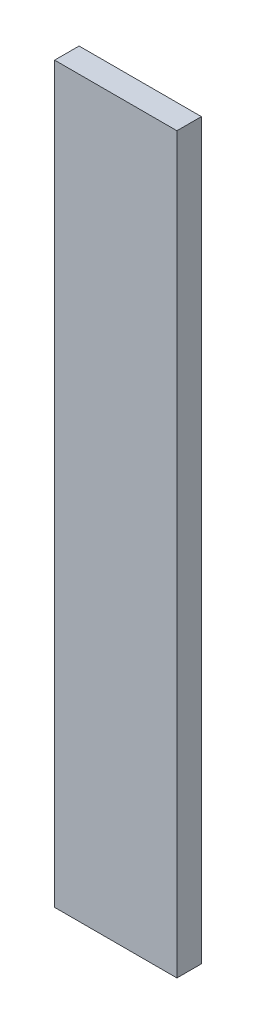
ISO-10303-21;
HEADER;
FILE_DESCRIPTION(('STEP AP214'),'2;1');
FILE_NAME('part.step','',(''),(''),'','','');
FILE_SCHEMA(('AUTOMOTIVE_DESIGN { 1 0 10303 214 1 1 1 1 }'));
ENDSEC;
DATA;
#1=APPLICATION_CONTEXT('core data for automotive mechanical design processes');
#2=APPLICATION_PROTOCOL_DEFINITION('international standard','automotive_design',2000,#1);
#3=PRODUCT_CONTEXT('',#1,'mechanical');
#4=PRODUCT('Part','Part','',(#3));
#5=PRODUCT_RELATED_PRODUCT_CATEGORY('part','',(#4));
#6=PRODUCT_DEFINITION_FORMATION('','',#4);
#7=PRODUCT_DEFINITION_CONTEXT('part definition',#1,'design');
#8=PRODUCT_DEFINITION('design','',#6,#7);
#9=PRODUCT_DEFINITION_SHAPE('','',#8);
#10=(LENGTH_UNIT() NAMED_UNIT(*) SI_UNIT(.MILLI.,.METRE.));
#11=(NAMED_UNIT(*) PLANE_ANGLE_UNIT() SI_UNIT($,.RADIAN.));
#12=(NAMED_UNIT(*) SI_UNIT($,.STERADIAN.) SOLID_ANGLE_UNIT());
#13=UNCERTAINTY_MEASURE_WITH_UNIT(LENGTH_MEASURE(1.E-05),#10,'distance_accuracy_value','');
#14=(GEOMETRIC_REPRESENTATION_CONTEXT(3) GLOBAL_UNCERTAINTY_ASSIGNED_CONTEXT((#13)) GLOBAL_UNIT_ASSIGNED_CONTEXT((#10,
#11,#12)) REPRESENTATION_CONTEXT('',''));
#15=CARTESIAN_POINT('',(0.,0.,0.));
#16=DIRECTION('',(0.,0.,1.));
#17=DIRECTION('',(1.,0.,0.));
#18=AXIS2_PLACEMENT_3D('',#15,#16,#17);
#19=CARTESIAN_POINT('',(0.,300.,10.));
#20=DIRECTION('',(0.,1.,0.));
#21=DIRECTION('',(0.,0.,1.));
#22=AXIS2_PLACEMENT_3D('',#19,#20,#21);
#23=PLANE('',#22);
#24=DIRECTION('',(1.,0.,0.));
#25=VECTOR('',#24,1.);
#26=CARTESIAN_POINT('',(0.,300.,0.));
#27=LINE('',#26,#25);
#28=CARTESIAN_POINT('',(0.,300.,0.));
#29=VERTEX_POINT('',#28);
#30=CARTESIAN_POINT('',(50.,300.,0.));
#31=VERTEX_POINT('',#30);
#32=EDGE_CURVE('E99',#29,#31,#27,.T.);
#33=ORIENTED_EDGE('',*,*,#32,.F.);
#34=DIRECTION('',(0.,0.,-1.));
#35=VECTOR('',#34,1.);
#36=CARTESIAN_POINT('',(0.,300.,10.));
#37=LINE('',#36,#35);
#38=CARTESIAN_POINT('',(0.,300.,10.));
#39=VERTEX_POINT('',#38);
#40=EDGE_CURVE('E11',#39,#29,#37,.T.);
#41=ORIENTED_EDGE('',*,*,#40,.F.);
#42=DIRECTION('',(1.,0.,0.));
#43=VECTOR('',#42,1.);
#44=CARTESIAN_POINT('',(0.,300.,10.));
#45=LINE('',#44,#43);
#46=CARTESIAN_POINT('',(50.,300.,10.));
#47=VERTEX_POINT('',#46);
#48=EDGE_CURVE('E93',#39,#47,#45,.T.);
#49=ORIENTED_EDGE('',*,*,#48,.T.);
#50=DIRECTION('',(0.,0.,-1.));
#51=VECTOR('',#50,1.);
#52=CARTESIAN_POINT('',(50.,300.,10.));
#53=LINE('',#52,#51);
#54=EDGE_CURVE('E38',#47,#31,#53,.T.);
#55=ORIENTED_EDGE('',*,*,#54,.T.);
#56=EDGE_LOOP('',(#33,#41,#49,#55));
#57=FACE_BOUND('',#56,.T.);
#58=ADVANCED_FACE('F35',(#57),#23,.T.);
#59=CARTESIAN_POINT('',(0.,0.,10.));
#60=DIRECTION('',(-1.,0.,0.));
#61=DIRECTION('',(0.,0.,1.));
#62=AXIS2_PLACEMENT_3D('',#59,#60,#61);
#63=PLANE('',#62);
#64=DIRECTION('',(0.,1.,0.));
#65=VECTOR('',#64,1.);
#66=CARTESIAN_POINT('',(0.,0.,0.));
#67=LINE('',#66,#65);
#68=CARTESIAN_POINT('',(0.,0.,0.));
#69=VERTEX_POINT('',#68);
#70=EDGE_CURVE('E95',#69,#29,#67,.T.);
#71=ORIENTED_EDGE('',*,*,#70,.F.);
#72=DIRECTION('',(0.,0.,-1.));
#73=VECTOR('',#72,1.);
#74=CARTESIAN_POINT('',(0.,0.,10.));
#75=LINE('',#74,#73);
#76=CARTESIAN_POINT('',(0.,0.,10.));
#77=VERTEX_POINT('',#76);
#78=EDGE_CURVE('E44',#77,#69,#75,.T.);
#79=ORIENTED_EDGE('',*,*,#78,.F.);
#80=DIRECTION('',(0.,1.,0.));
#81=VECTOR('',#80,1.);
#82=CARTESIAN_POINT('',(0.,0.,10.));
#83=LINE('',#82,#81);
#84=EDGE_CURVE('E90',#77,#39,#83,.T.);
#85=ORIENTED_EDGE('',*,*,#84,.T.);
#86=ORIENTED_EDGE('',*,*,#40,.T.);
#87=EDGE_LOOP('',(#71,#79,#85,#86));
#88=FACE_BOUND('',#87,.T.);
#89=ADVANCED_FACE('F109',(#88),#63,.T.);
#90=CARTESIAN_POINT('',(50.,0.,10.));
#91=DIRECTION('',(0.,-1.,0.));
#92=DIRECTION('',(1.,0.,0.));
#93=AXIS2_PLACEMENT_3D('',#90,#91,#92);
#94=PLANE('',#93);
#95=DIRECTION('',(-1.,0.,0.));
#96=VECTOR('',#95,1.);
#97=CARTESIAN_POINT('',(50.,0.,0.));
#98=LINE('',#97,#96);
#99=CARTESIAN_POINT('',(50.,0.,0.));
#100=VERTEX_POINT('',#99);
#101=EDGE_CURVE('E85',#100,#69,#98,.T.);
#102=ORIENTED_EDGE('',*,*,#101,.F.);
#103=DIRECTION('',(0.,0.,-1.));
#104=VECTOR('',#103,1.);
#105=CARTESIAN_POINT('',(50.,0.,10.));
#106=LINE('',#105,#104);
#107=CARTESIAN_POINT('',(50.,0.,10.));
#108=VERTEX_POINT('',#107);
#109=EDGE_CURVE('E80',#108,#100,#106,.T.);
#110=ORIENTED_EDGE('',*,*,#109,.F.);
#111=DIRECTION('',(-1.,0.,0.));
#112=VECTOR('',#111,1.);
#113=CARTESIAN_POINT('',(50.,0.,10.));
#114=LINE('',#113,#112);
#115=EDGE_CURVE('E83',#108,#77,#114,.T.);
#116=ORIENTED_EDGE('',*,*,#115,.T.);
#117=ORIENTED_EDGE('',*,*,#78,.T.);
#118=EDGE_LOOP('',(#102,#110,#116,#117));
#119=FACE_BOUND('',#118,.T.);
#120=ADVANCED_FACE('F82',(#119),#94,.T.);
#121=CARTESIAN_POINT('',(50.,300.,10.));
#122=DIRECTION('',(1.,0.,0.));
#123=DIRECTION('',(0.,1.,0.));
#124=AXIS2_PLACEMENT_3D('',#121,#122,#123);
#125=PLANE('',#124);
#126=DIRECTION('',(0.,-1.,0.));
#127=VECTOR('',#126,1.);
#128=CARTESIAN_POINT('',(50.,300.,0.));
#129=LINE('',#128,#127);
#130=EDGE_CURVE('E102',#31,#100,#129,.T.);
#131=ORIENTED_EDGE('',*,*,#130,.F.);
#132=ORIENTED_EDGE('',*,*,#54,.F.);
#133=DIRECTION('',(0.,-1.,0.));
#134=VECTOR('',#133,1.);
#135=CARTESIAN_POINT('',(50.,300.,10.));
#136=LINE('',#135,#134);
#137=EDGE_CURVE('E89',#47,#108,#136,.T.);
#138=ORIENTED_EDGE('',*,*,#137,.T.);
#139=ORIENTED_EDGE('',*,*,#109,.T.);
#140=EDGE_LOOP('',(#131,#132,#138,#139));
#141=FACE_BOUND('',#140,.T.);
#142=ADVANCED_FACE('F92',(#141),#125,.T.);
#143=CARTESIAN_POINT('',(0.,0.,10.));
#144=DIRECTION('',(0.,0.,-1.));
#145=DIRECTION('',(-1.,0.,0.));
#146=AXIS2_PLACEMENT_3D('',#143,#144,#145);
#147=PLANE('',#146);
#148=ORIENTED_EDGE('',*,*,#48,.F.);
#149=ORIENTED_EDGE('',*,*,#84,.F.);
#150=ORIENTED_EDGE('',*,*,#115,.F.);
#151=ORIENTED_EDGE('',*,*,#137,.F.);
#152=EDGE_LOOP('',(#148,#149,#150,#151));
#153=FACE_BOUND('',#152,.T.);
#154=ADVANCED_FACE('F88',(#153),#147,.F.);
#155=CARTESIAN_POINT('',(0.,0.,0.));
#156=DIRECTION('',(0.,0.,-1.));
#157=DIRECTION('',(-1.,0.,0.));
#158=AXIS2_PLACEMENT_3D('',#155,#156,#157);
#159=PLANE('',#158);
#160=ORIENTED_EDGE('',*,*,#32,.T.);
#161=ORIENTED_EDGE('',*,*,#130,.T.);
#162=ORIENTED_EDGE('',*,*,#101,.T.);
#163=ORIENTED_EDGE('',*,*,#70,.T.);
#164=EDGE_LOOP('',(#160,#161,#162,#163));
#165=FACE_BOUND('',#164,.T.);
#166=ADVANCED_FACE('F108',(#165),#159,.T.);
#167=CLOSED_SHELL('',(#58,#89,#120,#142,#154,#166));
#168=MANIFOLD_SOLID_BREP('B2',#167);
#169=ADVANCED_BREP_SHAPE_REPRESENTATION('',(#18,#168),#14);
#170=SHAPE_DEFINITION_REPRESENTATION(#9,#169);
ENDSEC;
END-ISO-10303-21;
